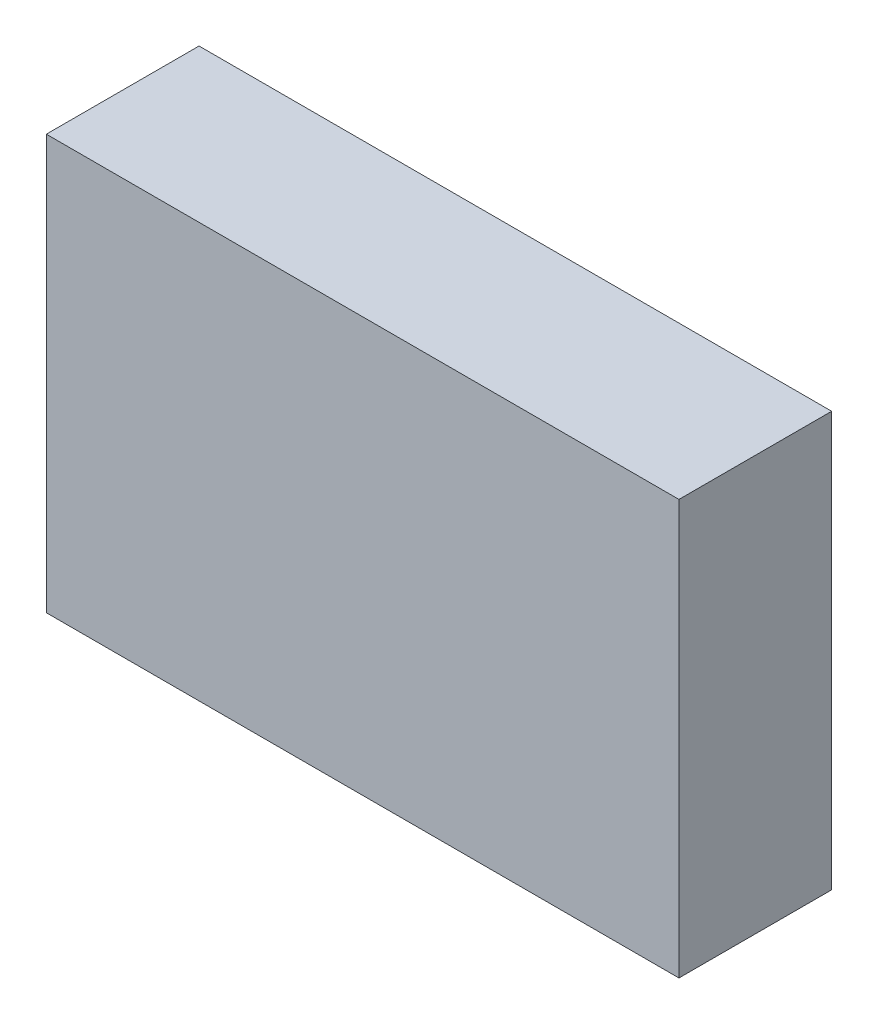
ISO-10303-21;
HEADER;
FILE_DESCRIPTION(('STEP AP214'),'2;1');
FILE_NAME('part.step','',(''),(''),'','','');
FILE_SCHEMA(('AUTOMOTIVE_DESIGN { 1 0 10303 214 1 1 1 1 }'));
ENDSEC;
DATA;
#1=APPLICATION_CONTEXT('core data for automotive mechanical design processes');
#2=APPLICATION_PROTOCOL_DEFINITION('international standard','automotive_design',2000,#1);
#3=PRODUCT_CONTEXT('',#1,'mechanical');
#4=PRODUCT('Part','Part','',(#3));
#5=PRODUCT_RELATED_PRODUCT_CATEGORY('part','',(#4));
#6=PRODUCT_DEFINITION_FORMATION('','',#4);
#7=PRODUCT_DEFINITION_CONTEXT('part definition',#1,'design');
#8=PRODUCT_DEFINITION('design','',#6,#7);
#9=PRODUCT_DEFINITION_SHAPE('','',#8);
#10=(LENGTH_UNIT() NAMED_UNIT(*) SI_UNIT(.MILLI.,.METRE.));
#11=(NAMED_UNIT(*) PLANE_ANGLE_UNIT() SI_UNIT($,.RADIAN.));
#12=(NAMED_UNIT(*) SI_UNIT($,.STERADIAN.) SOLID_ANGLE_UNIT());
#13=UNCERTAINTY_MEASURE_WITH_UNIT(LENGTH_MEASURE(1.E-05),#10,'distance_accuracy_value','');
#14=(GEOMETRIC_REPRESENTATION_CONTEXT(3) GLOBAL_UNCERTAINTY_ASSIGNED_CONTEXT((#13)) GLOBAL_UNIT_ASSIGNED_CONTEXT((#10,
#11,#12)) REPRESENTATION_CONTEXT('',''));
#15=CARTESIAN_POINT('',(0.,0.,0.));
#16=DIRECTION('',(0.,0.,1.));
#17=DIRECTION('',(1.,0.,0.));
#18=AXIS2_PLACEMENT_3D('',#15,#16,#17);
#19=CARTESIAN_POINT('',(290.,0.,0.));
#20=DIRECTION('',(-1.,0.,0.));
#21=DIRECTION('',(0.,0.,1.));
#22=AXIS2_PLACEMENT_3D('',#19,#20,#21);
#23=PLANE('',#22);
#24=DIRECTION('',(0.,0.,1.));
#25=VECTOR('',#24,1.);
#26=CARTESIAN_POINT('',(290.,190.,35.));
#27=LINE('',#26,#25);
#28=CARTESIAN_POINT('',(290.,190.,0.));
#29=VERTEX_POINT('',#28);
#30=CARTESIAN_POINT('',(290.,190.,70.));
#31=VERTEX_POINT('',#30);
#32=EDGE_CURVE('E21',#29,#31,#27,.T.);
#33=ORIENTED_EDGE('',*,*,#32,.T.);
#34=DIRECTION('',(0.,-1.,0.));
#35=VECTOR('',#34,1.);
#36=CARTESIAN_POINT('',(290.,95.,70.));
#37=LINE('',#36,#35);
#38=CARTESIAN_POINT('',(290.,0.,70.));
#39=VERTEX_POINT('',#38);
#40=EDGE_CURVE('E56',#31,#39,#37,.T.);
#41=ORIENTED_EDGE('',*,*,#40,.T.);
#42=DIRECTION('',(0.,0.,-1.));
#43=VECTOR('',#42,1.);
#44=CARTESIAN_POINT('',(290.,0.,35.));
#45=LINE('',#44,#43);
#46=CARTESIAN_POINT('',(290.,0.,0.));
#47=VERTEX_POINT('',#46);
#48=EDGE_CURVE('E77',#39,#47,#45,.T.);
#49=ORIENTED_EDGE('',*,*,#48,.T.);
#50=DIRECTION('',(0.,-1.,0.));
#51=VECTOR('',#50,1.);
#52=CARTESIAN_POINT('',(290.,95.,0.));
#53=LINE('',#52,#51);
#54=EDGE_CURVE('E59',#29,#47,#53,.T.);
#55=ORIENTED_EDGE('',*,*,#54,.F.);
#56=EDGE_LOOP('',(#33,#41,#49,#55));
#57=FACE_BOUND('',#56,.T.);
#58=ADVANCED_FACE('F17',(#57),#23,.F.);
#59=CARTESIAN_POINT('',(0.,190.,70.));
#60=DIRECTION('',(0.,-1.,0.));
#61=DIRECTION('',(0.,0.,-1.));
#62=AXIS2_PLACEMENT_3D('',#59,#60,#61);
#63=PLANE('',#62);
#64=DIRECTION('',(0.,0.,1.));
#65=VECTOR('',#64,1.);
#66=CARTESIAN_POINT('',(0.,190.,35.));
#67=LINE('',#66,#65);
#68=CARTESIAN_POINT('',(0.,190.,0.));
#69=VERTEX_POINT('',#68);
#70=CARTESIAN_POINT('',(0.,190.,70.));
#71=VERTEX_POINT('',#70);
#72=EDGE_CURVE('E74',#69,#71,#67,.T.);
#73=ORIENTED_EDGE('',*,*,#72,.T.);
#74=DIRECTION('',(1.,0.,0.));
#75=VECTOR('',#74,1.);
#76=CARTESIAN_POINT('',(145.,190.,70.));
#77=LINE('',#76,#75);
#78=EDGE_CURVE('E64',#71,#31,#77,.T.);
#79=ORIENTED_EDGE('',*,*,#78,.T.);
#80=ORIENTED_EDGE('',*,*,#32,.F.);
#81=DIRECTION('',(1.,0.,0.));
#82=VECTOR('',#81,1.);
#83=CARTESIAN_POINT('',(145.,190.,0.));
#84=LINE('',#83,#82);
#85=EDGE_CURVE('E79',#69,#29,#84,.T.);
#86=ORIENTED_EDGE('',*,*,#85,.F.);
#87=EDGE_LOOP('',(#73,#79,#80,#86));
#88=FACE_BOUND('',#87,.T.);
#89=ADVANCED_FACE('F73',(#88),#63,.F.);
#90=CARTESIAN_POINT('',(290.,0.,70.));
#91=DIRECTION('',(0.,0.,-1.));
#92=DIRECTION('',(-1.,0.,0.));
#93=AXIS2_PLACEMENT_3D('',#90,#91,#92);
#94=PLANE('',#93);
#95=DIRECTION('',(1.,0.,0.));
#96=VECTOR('',#95,1.);
#97=CARTESIAN_POINT('',(145.,0.,70.));
#98=LINE('',#97,#96);
#99=CARTESIAN_POINT('',(0.,0.,70.));
#100=VERTEX_POINT('',#99);
#101=EDGE_CURVE('E70',#100,#39,#98,.T.);
#102=ORIENTED_EDGE('',*,*,#101,.T.);
#103=ORIENTED_EDGE('',*,*,#40,.F.);
#104=ORIENTED_EDGE('',*,*,#78,.F.);
#105=DIRECTION('',(0.,-1.,0.));
#106=VECTOR('',#105,1.);
#107=CARTESIAN_POINT('',(0.,95.,70.));
#108=LINE('',#107,#106);
#109=EDGE_CURVE('E84',#71,#100,#108,.T.);
#110=ORIENTED_EDGE('',*,*,#109,.T.);
#111=EDGE_LOOP('',(#102,#103,#104,#110));
#112=FACE_BOUND('',#111,.T.);
#113=ADVANCED_FACE('F67',(#112),#94,.F.);
#114=CARTESIAN_POINT('',(0.,0.,0.));
#115=DIRECTION('',(0.,1.,0.));
#116=DIRECTION('',(0.,0.,1.));
#117=AXIS2_PLACEMENT_3D('',#114,#115,#116);
#118=PLANE('',#117);
#119=ORIENTED_EDGE('',*,*,#48,.F.);
#120=ORIENTED_EDGE('',*,*,#101,.F.);
#121=DIRECTION('',(0.,0.,-1.));
#122=VECTOR('',#121,1.);
#123=CARTESIAN_POINT('',(0.,0.,35.));
#124=LINE('',#123,#122);
#125=CARTESIAN_POINT('',(0.,0.,0.));
#126=VERTEX_POINT('',#125);
#127=EDGE_CURVE('E27',#100,#126,#124,.T.);
#128=ORIENTED_EDGE('',*,*,#127,.T.);
#129=DIRECTION('',(-1.,0.,0.));
#130=VECTOR('',#129,1.);
#131=CARTESIAN_POINT('',(145.,0.,0.));
#132=LINE('',#131,#130);
#133=EDGE_CURVE('E35',#47,#126,#132,.T.);
#134=ORIENTED_EDGE('',*,*,#133,.F.);
#135=EDGE_LOOP('',(#119,#120,#128,#134));
#136=FACE_BOUND('',#135,.T.);
#137=ADVANCED_FACE('F89',(#136),#118,.F.);
#138=CARTESIAN_POINT('',(290.,0.,0.));
#139=DIRECTION('',(0.,0.,-1.));
#140=DIRECTION('',(-1.,0.,0.));
#141=AXIS2_PLACEMENT_3D('',#138,#139,#140);
#142=PLANE('',#141);
#143=ORIENTED_EDGE('',*,*,#54,.T.);
#144=ORIENTED_EDGE('',*,*,#133,.T.);
#145=DIRECTION('',(0.,1.,0.));
#146=VECTOR('',#145,1.);
#147=CARTESIAN_POINT('',(0.,95.,0.));
#148=LINE('',#147,#146);
#149=EDGE_CURVE('E11',#126,#69,#148,.T.);
#150=ORIENTED_EDGE('',*,*,#149,.T.);
#151=ORIENTED_EDGE('',*,*,#85,.T.);
#152=EDGE_LOOP('',(#143,#144,#150,#151));
#153=FACE_BOUND('',#152,.T.);
#154=ADVANCED_FACE('F91',(#153),#142,.T.);
#155=CARTESIAN_POINT('',(0.,0.,70.));
#156=DIRECTION('',(1.,0.,0.));
#157=DIRECTION('',(0.,0.,-1.));
#158=AXIS2_PLACEMENT_3D('',#155,#156,#157);
#159=PLANE('',#158);
#160=ORIENTED_EDGE('',*,*,#127,.F.);
#161=ORIENTED_EDGE('',*,*,#109,.F.);
#162=ORIENTED_EDGE('',*,*,#72,.F.);
#163=ORIENTED_EDGE('',*,*,#149,.F.);
#164=EDGE_LOOP('',(#160,#161,#162,#163));
#165=FACE_BOUND('',#164,.T.);
#166=ADVANCED_FACE('F19',(#165),#159,.F.);
#167=CLOSED_SHELL('',(#58,#89,#113,#137,#154,#166));
#168=MANIFOLD_SOLID_BREP('B1',#167);
#169=ADVANCED_BREP_SHAPE_REPRESENTATION('',(#18,#168),#14);
#170=SHAPE_DEFINITION_REPRESENTATION(#9,#169);
ENDSEC;
END-ISO-10303-21;
